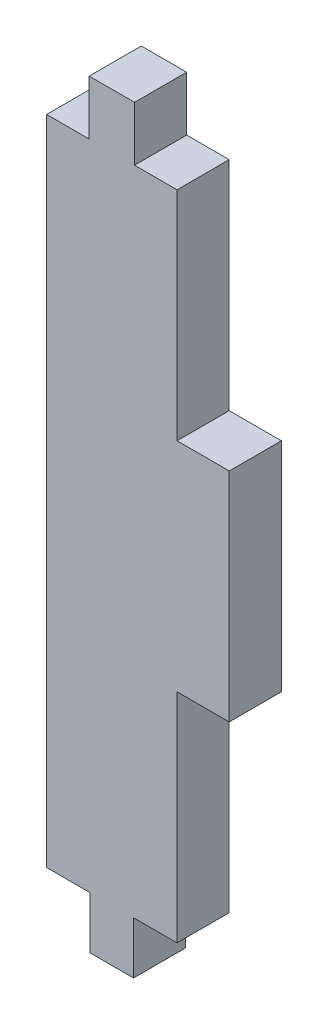
ISO-10303-21;
HEADER;
FILE_DESCRIPTION(('STEP AP214'),'2;1');
FILE_NAME('part.step','',(''),(''),'','','');
FILE_SCHEMA(('AUTOMOTIVE_DESIGN { 1 0 10303 214 1 1 1 1 }'));
ENDSEC;
DATA;
#1=APPLICATION_CONTEXT('core data for automotive mechanical design processes');
#2=APPLICATION_PROTOCOL_DEFINITION('international standard','automotive_design',2000,#1);
#3=PRODUCT_CONTEXT('',#1,'mechanical');
#4=PRODUCT('Part','Part','',(#3));
#5=PRODUCT_RELATED_PRODUCT_CATEGORY('part','',(#4));
#6=PRODUCT_DEFINITION_FORMATION('','',#4);
#7=PRODUCT_DEFINITION_CONTEXT('part definition',#1,'design');
#8=PRODUCT_DEFINITION('design','',#6,#7);
#9=PRODUCT_DEFINITION_SHAPE('','',#8);
#10=(LENGTH_UNIT() NAMED_UNIT(*) SI_UNIT(.MILLI.,.METRE.));
#11=(NAMED_UNIT(*) PLANE_ANGLE_UNIT() SI_UNIT($,.RADIAN.));
#12=(NAMED_UNIT(*) SI_UNIT($,.STERADIAN.) SOLID_ANGLE_UNIT());
#13=UNCERTAINTY_MEASURE_WITH_UNIT(LENGTH_MEASURE(1.E-05),#10,'distance_accuracy_value','');
#14=(GEOMETRIC_REPRESENTATION_CONTEXT(3) GLOBAL_UNCERTAINTY_ASSIGNED_CONTEXT((#13)) GLOBAL_UNIT_ASSIGNED_CONTEXT((#10,
#11,#12)) REPRESENTATION_CONTEXT('',''));
#15=CARTESIAN_POINT('',(0.,0.,0.));
#16=DIRECTION('',(0.,0.,1.));
#17=DIRECTION('',(1.,0.,0.));
#18=AXIS2_PLACEMENT_3D('',#15,#16,#17);
#19=CARTESIAN_POINT('',(-37.2306097479879,-66.1800034107966,0.));
#20=DIRECTION('',(0.,0.,1.));
#21=DIRECTION('',(1.,0.,0.));
#22=AXIS2_PLACEMENT_3D('',#19,#20,#21);
#23=PLANE('',#22);
#24=DIRECTION('',(1.,0.,0.));
#25=VECTOR('',#24,1.);
#26=CARTESIAN_POINT('',(-37.2306097479879,-66.1800034107966,0.));
#27=LINE('',#26,#25);
#28=CARTESIAN_POINT('',(-30.5639430813212,-66.1800034107966,0.));
#29=VERTEX_POINT('',#28);
#30=CARTESIAN_POINT('',(-27.2306097479879,-66.1800034107966,0.));
#31=VERTEX_POINT('',#30);
#32=EDGE_CURVE('E224',#29,#31,#27,.T.);
#33=ORIENTED_EDGE('',*,*,#32,.F.);
#34=DIRECTION('',(0.,-1.,0.));
#35=VECTOR('',#34,1.);
#36=CARTESIAN_POINT('',(-30.5639430813212,-62.1800034107967,0.));
#37=LINE('',#36,#35);
#38=CARTESIAN_POINT('',(-30.5639430813212,-70.1800034107967,0.));
#39=VERTEX_POINT('',#38);
#40=EDGE_CURVE('E306',#29,#39,#37,.T.);
#41=ORIENTED_EDGE('',*,*,#40,.T.);
#42=DIRECTION('',(1.,0.,0.));
#43=VECTOR('',#42,1.);
#44=CARTESIAN_POINT('',(-33.8972764146545,-70.1800034107967,0.));
#45=LINE('',#44,#43);
#46=CARTESIAN_POINT('',(-33.8972764146545,-70.1800034107967,0.));
#47=VERTEX_POINT('',#46);
#48=EDGE_CURVE('E308',#47,#39,#45,.T.);
#49=ORIENTED_EDGE('',*,*,#48,.F.);
#50=DIRECTION('',(0.,-1.,0.));
#51=VECTOR('',#50,1.);
#52=CARTESIAN_POINT('',(-33.8972764146545,-62.1800034107967,0.));
#53=LINE('',#52,#51);
#54=CARTESIAN_POINT('',(-33.8972764146545,-66.1800034107966,0.));
#55=VERTEX_POINT('',#54);
#56=EDGE_CURVE('E301',#55,#47,#53,.T.);
#57=ORIENTED_EDGE('',*,*,#56,.F.);
#58=CARTESIAN_POINT('',(-37.2306097479879,-66.1800034107966,0.));
#59=VERTEX_POINT('',#58);
#60=EDGE_CURVE('E219',#59,#55,#27,.T.);
#61=ORIENTED_EDGE('',*,*,#60,.F.);
#62=DIRECTION('',(0.,-1.,0.));
#63=VECTOR('',#62,1.);
#64=CARTESIAN_POINT('',(-37.2306097479879,-16.1800034107966,0.));
#65=LINE('',#64,#63);
#66=CARTESIAN_POINT('',(-37.2306097479879,-16.1800034107966,0.));
#67=VERTEX_POINT('',#66);
#68=EDGE_CURVE('E296',#67,#59,#65,.T.);
#69=ORIENTED_EDGE('',*,*,#68,.F.);
#70=DIRECTION('',(1.,0.,0.));
#71=VECTOR('',#70,1.);
#72=CARTESIAN_POINT('',(-37.2306097479879,-16.1800034107966,0.));
#73=LINE('',#72,#71);
#74=CARTESIAN_POINT('',(-33.9704459293163,-16.1800034107966,0.));
#75=VERTEX_POINT('',#74);
#76=EDGE_CURVE('E235',#67,#75,#73,.T.);
#77=ORIENTED_EDGE('',*,*,#76,.T.);
#78=DIRECTION('',(0.,-1.,0.));
#79=VECTOR('',#78,1.);
#80=CARTESIAN_POINT('',(-33.9704459293163,-12.0043965756084,0.));
#81=LINE('',#80,#79);
#82=CARTESIAN_POINT('',(-33.9704459293163,-12.0043965756084,0.));
#83=VERTEX_POINT('',#82);
#84=EDGE_CURVE('E280',#83,#75,#81,.T.);
#85=ORIENTED_EDGE('',*,*,#84,.F.);
#86=DIRECTION('',(1.,0.,0.));
#87=VECTOR('',#86,1.);
#88=CARTESIAN_POINT('',(-33.9704459293163,-12.0043965756084,0.));
#89=LINE('',#88,#87);
#90=CARTESIAN_POINT('',(-30.4907735666594,-12.0043965756084,0.));
#91=VERTEX_POINT('',#90);
#92=EDGE_CURVE('E286',#83,#91,#89,.T.);
#93=ORIENTED_EDGE('',*,*,#92,.T.);
#94=DIRECTION('',(0.,-1.,0.));
#95=VECTOR('',#94,1.);
#96=CARTESIAN_POINT('',(-30.4907735666594,-12.0043965756084,0.));
#97=LINE('',#96,#95);
#98=CARTESIAN_POINT('',(-30.4907735666594,-16.1800034107966,0.));
#99=VERTEX_POINT('',#98);
#100=EDGE_CURVE('E289',#91,#99,#97,.T.);
#101=ORIENTED_EDGE('',*,*,#100,.T.);
#102=CARTESIAN_POINT('',(-27.2306097479879,-16.1800034107966,0.));
#103=VERTEX_POINT('',#102);
#104=EDGE_CURVE('E221',#99,#103,#73,.T.);
#105=ORIENTED_EDGE('',*,*,#104,.T.);
#106=DIRECTION('',(0.,-1.,0.));
#107=VECTOR('',#106,1.);
#108=CARTESIAN_POINT('',(-27.2306097479879,-16.1800034107966,0.));
#109=LINE('',#108,#107);
#110=CARTESIAN_POINT('',(-27.2306097479879,-32.8466700774633,0.));
#111=VERTEX_POINT('',#110);
#112=EDGE_CURVE('E190',#103,#111,#109,.T.);
#113=ORIENTED_EDGE('',*,*,#112,.T.);
#114=DIRECTION('',(1.,0.,0.));
#115=VECTOR('',#114,1.);
#116=CARTESIAN_POINT('',(-27.2306097479879,-32.8466700774633,0.));
#117=LINE('',#116,#115);
#118=CARTESIAN_POINT('',(-23.2306097479879,-32.8466700774633,0.));
#119=VERTEX_POINT('',#118);
#120=EDGE_CURVE('E175',#111,#119,#117,.T.);
#121=ORIENTED_EDGE('',*,*,#120,.T.);
#122=DIRECTION('',(0.,1.,0.));
#123=VECTOR('',#122,1.);
#124=CARTESIAN_POINT('',(-23.2306097479879,-49.51333674413,0.));
#125=LINE('',#124,#123);
#126=CARTESIAN_POINT('',(-23.2306097479879,-49.51333674413,0.));
#127=VERTEX_POINT('',#126);
#128=EDGE_CURVE('E164',#127,#119,#125,.T.);
#129=ORIENTED_EDGE('',*,*,#128,.F.);
#130=DIRECTION('',(1.,0.,0.));
#131=VECTOR('',#130,1.);
#132=CARTESIAN_POINT('',(-27.2306097479879,-49.51333674413,0.));
#133=LINE('',#132,#131);
#134=CARTESIAN_POINT('',(-27.2306097479879,-49.51333674413,0.));
#135=VERTEX_POINT('',#134);
#136=EDGE_CURVE('E185',#135,#127,#133,.T.);
#137=ORIENTED_EDGE('',*,*,#136,.F.);
#138=EDGE_CURVE('E210',#135,#31,#109,.T.);
#139=ORIENTED_EDGE('',*,*,#138,.T.);
#140=EDGE_LOOP('',(#33,#41,#49,#57,#61,#69,#77,#85,#93,#101,#105,#113,#121,#129,#137,#139));
#141=FACE_BOUND('',#140,.T.);
#142=ADVANCED_FACE('F102',(#141),#23,.F.);
#143=CARTESIAN_POINT('',(-37.2306097479879,-66.1800034107966,4.));
#144=DIRECTION('',(0.,0.,1.));
#145=DIRECTION('',(1.,0.,0.));
#146=AXIS2_PLACEMENT_3D('',#143,#144,#145);
#147=PLANE('',#146);
#148=DIRECTION('',(1.,0.,0.));
#149=VECTOR('',#148,1.);
#150=CARTESIAN_POINT('',(-37.2306097479879,-66.1800034107966,4.));
#151=LINE('',#150,#149);
#152=CARTESIAN_POINT('',(-37.2306097479879,-66.1800034107966,4.));
#153=VERTEX_POINT('',#152);
#154=CARTESIAN_POINT('',(-33.8972764146545,-66.1800034107966,4.));
#155=VERTEX_POINT('',#154);
#156=EDGE_CURVE('E339',#153,#155,#151,.T.);
#157=ORIENTED_EDGE('',*,*,#156,.T.);
#158=DIRECTION('',(0.,-1.,0.));
#159=VECTOR('',#158,1.);
#160=CARTESIAN_POINT('',(-33.8972764146545,-62.1800034107967,4.));
#161=LINE('',#160,#159);
#162=CARTESIAN_POINT('',(-33.8972764146545,-70.1800034107967,4.));
#163=VERTEX_POINT('',#162);
#164=EDGE_CURVE('E304',#155,#163,#161,.T.);
#165=ORIENTED_EDGE('',*,*,#164,.T.);
#166=DIRECTION('',(1.,0.,0.));
#167=VECTOR('',#166,1.);
#168=CARTESIAN_POINT('',(-33.8972764146545,-70.1800034107967,4.));
#169=LINE('',#168,#167);
#170=CARTESIAN_POINT('',(-30.5639430813212,-70.1800034107967,4.));
#171=VERTEX_POINT('',#170);
#172=EDGE_CURVE('E300',#163,#171,#169,.T.);
#173=ORIENTED_EDGE('',*,*,#172,.T.);
#174=DIRECTION('',(0.,-1.,0.));
#175=VECTOR('',#174,1.);
#176=CARTESIAN_POINT('',(-30.5639430813212,-62.1800034107967,4.));
#177=LINE('',#176,#175);
#178=CARTESIAN_POINT('',(-30.5639430813212,-66.1800034107966,4.));
#179=VERTEX_POINT('',#178);
#180=EDGE_CURVE('E298',#179,#171,#177,.T.);
#181=ORIENTED_EDGE('',*,*,#180,.F.);
#182=CARTESIAN_POINT('',(-27.2306097479879,-66.1800034107966,4.));
#183=VERTEX_POINT('',#182);
#184=EDGE_CURVE('E348',#179,#183,#151,.T.);
#185=ORIENTED_EDGE('',*,*,#184,.T.);
#186=DIRECTION('',(0.,-1.,0.));
#187=VECTOR('',#186,1.);
#188=CARTESIAN_POINT('',(-27.2306097479879,-16.1800034107966,4.));
#189=LINE('',#188,#187);
#190=CARTESIAN_POINT('',(-27.2306097479879,-49.51333674413,4.));
#191=VERTEX_POINT('',#190);
#192=EDGE_CURVE('E342',#191,#183,#189,.T.);
#193=ORIENTED_EDGE('',*,*,#192,.F.);
#194=DIRECTION('',(1.,0.,0.));
#195=VECTOR('',#194,1.);
#196=CARTESIAN_POINT('',(-27.2306097479879,-49.51333674413,4.));
#197=LINE('',#196,#195);
#198=CARTESIAN_POINT('',(-23.2306097479879,-49.51333674413,4.));
#199=VERTEX_POINT('',#198);
#200=EDGE_CURVE('E191',#191,#199,#197,.T.);
#201=ORIENTED_EDGE('',*,*,#200,.T.);
#202=DIRECTION('',(0.,1.,0.));
#203=VECTOR('',#202,1.);
#204=CARTESIAN_POINT('',(-23.2306097479879,-49.51333674413,4.));
#205=LINE('',#204,#203);
#206=CARTESIAN_POINT('',(-23.2306097479879,-32.8466700774633,4.));
#207=VERTEX_POINT('',#206);
#208=EDGE_CURVE('E194',#199,#207,#205,.T.);
#209=ORIENTED_EDGE('',*,*,#208,.T.);
#210=DIRECTION('',(1.,0.,0.));
#211=VECTOR('',#210,1.);
#212=CARTESIAN_POINT('',(-27.2306097479879,-32.8466700774633,4.));
#213=LINE('',#212,#211);
#214=CARTESIAN_POINT('',(-27.2306097479879,-32.8466700774633,4.));
#215=VERTEX_POINT('',#214);
#216=EDGE_CURVE('E178',#215,#207,#213,.T.);
#217=ORIENTED_EDGE('',*,*,#216,.F.);
#218=CARTESIAN_POINT('',(-27.2306097479879,-16.1800034107966,4.));
#219=VERTEX_POINT('',#218);
#220=EDGE_CURVE('E229',#219,#215,#189,.T.);
#221=ORIENTED_EDGE('',*,*,#220,.F.);
#222=DIRECTION('',(1.,0.,0.));
#223=VECTOR('',#222,1.);
#224=CARTESIAN_POINT('',(-37.2306097479879,-16.1800034107966,4.));
#225=LINE('',#224,#223);
#226=CARTESIAN_POINT('',(-30.4907735666594,-16.1800034107966,4.));
#227=VERTEX_POINT('',#226);
#228=EDGE_CURVE('E336',#227,#219,#225,.T.);
#229=ORIENTED_EDGE('',*,*,#228,.F.);
#230=DIRECTION('',(0.,-1.,0.));
#231=VECTOR('',#230,1.);
#232=CARTESIAN_POINT('',(-30.4907735666594,-12.0043965756084,4.));
#233=LINE('',#232,#231);
#234=CARTESIAN_POINT('',(-30.4907735666594,-12.0043965756084,4.));
#235=VERTEX_POINT('',#234);
#236=EDGE_CURVE('E279',#235,#227,#233,.T.);
#237=ORIENTED_EDGE('',*,*,#236,.F.);
#238=DIRECTION('',(1.,0.,0.));
#239=VECTOR('',#238,1.);
#240=CARTESIAN_POINT('',(-33.9704459293163,-12.0043965756084,4.));
#241=LINE('',#240,#239);
#242=CARTESIAN_POINT('',(-33.9704459293163,-12.0043965756084,4.));
#243=VERTEX_POINT('',#242);
#244=EDGE_CURVE('E276',#243,#235,#241,.T.);
#245=ORIENTED_EDGE('',*,*,#244,.F.);
#246=DIRECTION('',(0.,-1.,0.));
#247=VECTOR('',#246,1.);
#248=CARTESIAN_POINT('',(-33.9704459293163,-12.0043965756084,4.));
#249=LINE('',#248,#247);
#250=CARTESIAN_POINT('',(-33.9704459293163,-16.1800034107966,4.));
#251=VERTEX_POINT('',#250);
#252=EDGE_CURVE('E282',#243,#251,#249,.T.);
#253=ORIENTED_EDGE('',*,*,#252,.T.);
#254=CARTESIAN_POINT('',(-37.2306097479879,-16.1800034107966,4.));
#255=VERTEX_POINT('',#254);
#256=EDGE_CURVE('E244',#255,#251,#225,.T.);
#257=ORIENTED_EDGE('',*,*,#256,.F.);
#258=DIRECTION('',(0.,-1.,0.));
#259=VECTOR('',#258,1.);
#260=CARTESIAN_POINT('',(-37.2306097479879,-16.1800034107966,4.));
#261=LINE('',#260,#259);
#262=EDGE_CURVE('E239',#255,#153,#261,.T.);
#263=ORIENTED_EDGE('',*,*,#262,.T.);
#264=EDGE_LOOP('',(#157,#165,#173,#181,#185,#193,#201,#209,#217,#221,#229,#237,#245,#253,#257,#263));
#265=FACE_BOUND('',#264,.T.);
#266=ADVANCED_FACE('F354',(#265),#147,.T.);
#267=CARTESIAN_POINT('',(-37.2306097479879,-16.1800034107966,4.));
#268=DIRECTION('',(0.,1.,0.));
#269=DIRECTION('',(0.,0.,1.));
#270=AXIS2_PLACEMENT_3D('',#267,#268,#269);
#271=PLANE('',#270);
#272=ORIENTED_EDGE('',*,*,#256,.T.);
#273=DIRECTION('',(0.,0.,-1.));
#274=VECTOR('',#273,1.);
#275=CARTESIAN_POINT('',(-33.9704459293163,-16.1800034107966,4.));
#276=LINE('',#275,#274);
#277=EDGE_CURVE('E253',#251,#75,#276,.T.);
#278=ORIENTED_EDGE('',*,*,#277,.T.);
#279=ORIENTED_EDGE('',*,*,#76,.F.);
#280=DIRECTION('',(0.,0.,-1.));
#281=VECTOR('',#280,1.);
#282=CARTESIAN_POINT('',(-37.2306097479879,-16.1800034107966,4.));
#283=LINE('',#282,#281);
#284=EDGE_CURVE('E240',#255,#67,#283,.T.);
#285=ORIENTED_EDGE('',*,*,#284,.F.);
#286=EDGE_LOOP('',(#272,#278,#279,#285));
#287=FACE_BOUND('',#286,.T.);
#288=ADVANCED_FACE('F361',(#287),#271,.T.);
#289=CARTESIAN_POINT('',(-37.2306097479879,-16.1800034107966,4.));
#290=DIRECTION('',(1.,0.,0.));
#291=DIRECTION('',(0.,1.,0.));
#292=AXIS2_PLACEMENT_3D('',#289,#290,#291);
#293=PLANE('',#292);
#294=ORIENTED_EDGE('',*,*,#68,.T.);
#295=DIRECTION('',(0.,0.,-1.));
#296=VECTOR('',#295,1.);
#297=CARTESIAN_POINT('',(-37.2306097479879,-66.1800034107966,4.));
#298=LINE('',#297,#296);
#299=EDGE_CURVE('E247',#153,#59,#298,.T.);
#300=ORIENTED_EDGE('',*,*,#299,.F.);
#301=ORIENTED_EDGE('',*,*,#262,.F.);
#302=ORIENTED_EDGE('',*,*,#284,.T.);
#303=EDGE_LOOP('',(#294,#300,#301,#302));
#304=FACE_BOUND('',#303,.T.);
#305=ADVANCED_FACE('F358',(#304),#293,.F.);
#306=CARTESIAN_POINT('',(-37.2306097479879,-66.1800034107966,4.));
#307=DIRECTION('',(0.,1.,0.));
#308=DIRECTION('',(0.,0.,1.));
#309=AXIS2_PLACEMENT_3D('',#306,#307,#308);
#310=PLANE('',#309);
#311=DIRECTION('',(0.,0.,-1.));
#312=VECTOR('',#311,1.);
#313=CARTESIAN_POINT('',(-33.8972764146545,-66.1800034107966,4.));
#314=LINE('',#313,#312);
#315=EDGE_CURVE('E263',#155,#55,#314,.T.);
#316=ORIENTED_EDGE('',*,*,#315,.F.);
#317=ORIENTED_EDGE('',*,*,#156,.F.);
#318=ORIENTED_EDGE('',*,*,#299,.T.);
#319=ORIENTED_EDGE('',*,*,#60,.T.);
#320=EDGE_LOOP('',(#316,#317,#318,#319));
#321=FACE_BOUND('',#320,.T.);
#322=ADVANCED_FACE('F360',(#321),#310,.F.);
#323=ORIENTED_EDGE('',*,*,#184,.F.);
#324=DIRECTION('',(0.,0.,-1.));
#325=VECTOR('',#324,1.);
#326=CARTESIAN_POINT('',(-30.5639430813212,-66.1800034107966,4.));
#327=LINE('',#326,#325);
#328=EDGE_CURVE('E260',#179,#29,#327,.T.);
#329=ORIENTED_EDGE('',*,*,#328,.T.);
#330=ORIENTED_EDGE('',*,*,#32,.T.);
#331=DIRECTION('',(0.,0.,-1.));
#332=VECTOR('',#331,1.);
#333=CARTESIAN_POINT('',(-27.2306097479879,-66.1800034107966,4.));
#334=LINE('',#333,#332);
#335=EDGE_CURVE('E218',#183,#31,#334,.T.);
#336=ORIENTED_EDGE('',*,*,#335,.F.);
#337=EDGE_LOOP('',(#323,#329,#330,#336));
#338=FACE_BOUND('',#337,.T.);
#339=ADVANCED_FACE('F367',(#338),#310,.F.);
#340=CARTESIAN_POINT('',(-27.2306097479879,-16.1800034107966,4.));
#341=DIRECTION('',(1.,0.,0.));
#342=DIRECTION('',(0.,1.,0.));
#343=AXIS2_PLACEMENT_3D('',#340,#341,#342);
#344=PLANE('',#343);
#345=DIRECTION('',(0.,0.,-1.));
#346=VECTOR('',#345,1.);
#347=CARTESIAN_POINT('',(-27.2306097479879,-49.51333674413,4.));
#348=LINE('',#347,#346);
#349=EDGE_CURVE('E12',#191,#135,#348,.T.);
#350=ORIENTED_EDGE('',*,*,#349,.F.);
#351=ORIENTED_EDGE('',*,*,#192,.T.);
#352=ORIENTED_EDGE('',*,*,#335,.T.);
#353=ORIENTED_EDGE('',*,*,#138,.F.);
#354=EDGE_LOOP('',(#350,#351,#352,#353));
#355=FACE_BOUND('',#354,.T.);
#356=ADVANCED_FACE('F215',(#355),#344,.T.);
#357=ORIENTED_EDGE('',*,*,#220,.T.);
#358=DIRECTION('',(0.,0.,-1.));
#359=VECTOR('',#358,1.);
#360=CARTESIAN_POINT('',(-27.2306097479879,-32.8466700774633,4.));
#361=LINE('',#360,#359);
#362=EDGE_CURVE('E112',#215,#111,#361,.T.);
#363=ORIENTED_EDGE('',*,*,#362,.T.);
#364=ORIENTED_EDGE('',*,*,#112,.F.);
#365=DIRECTION('',(0.,0.,-1.));
#366=VECTOR('',#365,1.);
#367=CARTESIAN_POINT('',(-27.2306097479879,-16.1800034107966,4.));
#368=LINE('',#367,#366);
#369=EDGE_CURVE('E243',#219,#103,#368,.T.);
#370=ORIENTED_EDGE('',*,*,#369,.F.);
#371=EDGE_LOOP('',(#357,#363,#364,#370));
#372=FACE_BOUND('',#371,.T.);
#373=ADVANCED_FACE('F407',(#372),#344,.T.);
#374=DIRECTION('',(0.,0.,-1.));
#375=VECTOR('',#374,1.);
#376=CARTESIAN_POINT('',(-30.4907735666594,-16.1800034107966,4.));
#377=LINE('',#376,#375);
#378=EDGE_CURVE('E121',#227,#99,#377,.T.);
#379=ORIENTED_EDGE('',*,*,#378,.F.);
#380=ORIENTED_EDGE('',*,*,#228,.T.);
#381=ORIENTED_EDGE('',*,*,#369,.T.);
#382=ORIENTED_EDGE('',*,*,#104,.F.);
#383=EDGE_LOOP('',(#379,#380,#381,#382));
#384=FACE_BOUND('',#383,.T.);
#385=ADVANCED_FACE('F371',(#384),#271,.T.);
#386=CARTESIAN_POINT('',(-33.8972764146545,-70.1800034107967,4.));
#387=DIRECTION('',(0.,1.,0.));
#388=DIRECTION('',(0.,0.,1.));
#389=AXIS2_PLACEMENT_3D('',#386,#387,#388);
#390=PLANE('',#389);
#391=ORIENTED_EDGE('',*,*,#48,.T.);
#392=DIRECTION('',(0.,0.,-1.));
#393=VECTOR('',#392,1.);
#394=CARTESIAN_POINT('',(-30.5639430813212,-70.1800034107967,4.));
#395=LINE('',#394,#393);
#396=EDGE_CURVE('E268',#171,#39,#395,.T.);
#397=ORIENTED_EDGE('',*,*,#396,.F.);
#398=ORIENTED_EDGE('',*,*,#172,.F.);
#399=DIRECTION('',(0.,0.,-1.));
#400=VECTOR('',#399,1.);
#401=CARTESIAN_POINT('',(-33.8972764146545,-70.1800034107967,4.));
#402=LINE('',#401,#400);
#403=EDGE_CURVE('E290',#163,#47,#402,.T.);
#404=ORIENTED_EDGE('',*,*,#403,.T.);
#405=EDGE_LOOP('',(#391,#397,#398,#404));
#406=FACE_BOUND('',#405,.T.);
#407=ADVANCED_FACE('F324',(#406),#390,.F.);
#408=CARTESIAN_POINT('',(-30.5639430813212,-62.1800034107967,4.));
#409=DIRECTION('',(1.,0.,0.));
#410=DIRECTION('',(0.,0.,-1.));
#411=AXIS2_PLACEMENT_3D('',#408,#409,#410);
#412=PLANE('',#411);
#413=ORIENTED_EDGE('',*,*,#328,.F.);
#414=ORIENTED_EDGE('',*,*,#180,.T.);
#415=ORIENTED_EDGE('',*,*,#396,.T.);
#416=ORIENTED_EDGE('',*,*,#40,.F.);
#417=EDGE_LOOP('',(#413,#414,#415,#416));
#418=FACE_BOUND('',#417,.T.);
#419=ADVANCED_FACE('F321',(#418),#412,.T.);
#420=CARTESIAN_POINT('',(-33.8972764146545,-62.1800034107967,4.));
#421=DIRECTION('',(1.,0.,0.));
#422=DIRECTION('',(0.,0.,-1.));
#423=AXIS2_PLACEMENT_3D('',#420,#421,#422);
#424=PLANE('',#423);
#425=ORIENTED_EDGE('',*,*,#164,.F.);
#426=ORIENTED_EDGE('',*,*,#315,.T.);
#427=ORIENTED_EDGE('',*,*,#56,.T.);
#428=ORIENTED_EDGE('',*,*,#403,.F.);
#429=EDGE_LOOP('',(#425,#426,#427,#428));
#430=FACE_BOUND('',#429,.T.);
#431=ADVANCED_FACE('F385',(#430),#424,.F.);
#432=CARTESIAN_POINT('',(-23.2306097479879,-49.51333674413,4.));
#433=DIRECTION('',(-1.,0.,0.));
#434=DIRECTION('',(0.,0.,1.));
#435=AXIS2_PLACEMENT_3D('',#432,#433,#434);
#436=PLANE('',#435);
#437=ORIENTED_EDGE('',*,*,#128,.T.);
#438=DIRECTION('',(0.,0.,-1.));
#439=VECTOR('',#438,1.);
#440=CARTESIAN_POINT('',(-23.2306097479879,-32.8466700774633,4.));
#441=LINE('',#440,#439);
#442=EDGE_CURVE('E171',#207,#119,#441,.T.);
#443=ORIENTED_EDGE('',*,*,#442,.F.);
#444=ORIENTED_EDGE('',*,*,#208,.F.);
#445=DIRECTION('',(0.,0.,-1.));
#446=VECTOR('',#445,1.);
#447=CARTESIAN_POINT('',(-23.2306097479879,-49.51333674413,4.));
#448=LINE('',#447,#446);
#449=EDGE_CURVE('E180',#199,#127,#448,.T.);
#450=ORIENTED_EDGE('',*,*,#449,.T.);
#451=EDGE_LOOP('',(#437,#443,#444,#450));
#452=FACE_BOUND('',#451,.T.);
#453=ADVANCED_FACE('F182',(#452),#436,.F.);
#454=CARTESIAN_POINT('',(-27.2306097479879,-32.8466700774633,4.));
#455=DIRECTION('',(0.,1.,0.));
#456=DIRECTION('',(0.,0.,1.));
#457=AXIS2_PLACEMENT_3D('',#454,#455,#456);
#458=PLANE('',#457);
#459=ORIENTED_EDGE('',*,*,#120,.F.);
#460=ORIENTED_EDGE('',*,*,#362,.F.);
#461=ORIENTED_EDGE('',*,*,#216,.T.);
#462=ORIENTED_EDGE('',*,*,#442,.T.);
#463=EDGE_LOOP('',(#459,#460,#461,#462));
#464=FACE_BOUND('',#463,.T.);
#465=ADVANCED_FACE('F172',(#464),#458,.T.);
#466=CARTESIAN_POINT('',(-27.2306097479879,-49.51333674413,4.));
#467=DIRECTION('',(0.,1.,0.));
#468=DIRECTION('',(0.,0.,1.));
#469=AXIS2_PLACEMENT_3D('',#466,#467,#468);
#470=PLANE('',#469);
#471=ORIENTED_EDGE('',*,*,#136,.T.);
#472=ORIENTED_EDGE('',*,*,#449,.F.);
#473=ORIENTED_EDGE('',*,*,#200,.F.);
#474=ORIENTED_EDGE('',*,*,#349,.T.);
#475=EDGE_LOOP('',(#471,#472,#473,#474));
#476=FACE_BOUND('',#475,.T.);
#477=ADVANCED_FACE('F104',(#476),#470,.F.);
#478=CARTESIAN_POINT('',(-30.4907735666594,-12.0043965756084,4.));
#479=DIRECTION('',(1.,0.,0.));
#480=DIRECTION('',(0.,0.,-1.));
#481=AXIS2_PLACEMENT_3D('',#478,#479,#480);
#482=PLANE('',#481);
#483=ORIENTED_EDGE('',*,*,#236,.T.);
#484=ORIENTED_EDGE('',*,*,#378,.T.);
#485=ORIENTED_EDGE('',*,*,#100,.F.);
#486=DIRECTION('',(0.,0.,-1.));
#487=VECTOR('',#486,1.);
#488=CARTESIAN_POINT('',(-30.4907735666594,-12.0043965756084,4.));
#489=LINE('',#488,#487);
#490=EDGE_CURVE('E285',#235,#91,#489,.T.);
#491=ORIENTED_EDGE('',*,*,#490,.F.);
#492=EDGE_LOOP('',(#483,#484,#485,#491));
#493=FACE_BOUND('',#492,.T.);
#494=ADVANCED_FACE('F379',(#493),#482,.T.);
#495=CARTESIAN_POINT('',(-33.9704459293163,-12.0043965756084,4.));
#496=DIRECTION('',(0.,1.,0.));
#497=DIRECTION('',(0.,0.,1.));
#498=AXIS2_PLACEMENT_3D('',#495,#496,#497);
#499=PLANE('',#498);
#500=ORIENTED_EDGE('',*,*,#92,.F.);
#501=DIRECTION('',(0.,0.,-1.));
#502=VECTOR('',#501,1.);
#503=CARTESIAN_POINT('',(-33.9704459293163,-12.0043965756084,4.));
#504=LINE('',#503,#502);
#505=EDGE_CURVE('E294',#243,#83,#504,.T.);
#506=ORIENTED_EDGE('',*,*,#505,.F.);
#507=ORIENTED_EDGE('',*,*,#244,.T.);
#508=ORIENTED_EDGE('',*,*,#490,.T.);
#509=EDGE_LOOP('',(#500,#506,#507,#508));
#510=FACE_BOUND('',#509,.T.);
#511=ADVANCED_FACE('F377',(#510),#499,.T.);
#512=CARTESIAN_POINT('',(-33.9704459293163,-12.0043965756084,4.));
#513=DIRECTION('',(1.,0.,0.));
#514=DIRECTION('',(0.,0.,-1.));
#515=AXIS2_PLACEMENT_3D('',#512,#513,#514);
#516=PLANE('',#515);
#517=ORIENTED_EDGE('',*,*,#277,.F.);
#518=ORIENTED_EDGE('',*,*,#252,.F.);
#519=ORIENTED_EDGE('',*,*,#505,.T.);
#520=ORIENTED_EDGE('',*,*,#84,.T.);
#521=EDGE_LOOP('',(#517,#518,#519,#520));
#522=FACE_BOUND('',#521,.T.);
#523=ADVANCED_FACE('F374',(#522),#516,.F.);
#524=CLOSED_SHELL('',(#142,#266,#288,#305,#322,#339,#356,#373,#385,#407,#419,#431,#453,#465,
#477,#494,#511,#523));
#525=MANIFOLD_SOLID_BREP('B2',#524);
#526=ADVANCED_BREP_SHAPE_REPRESENTATION('',(#18,#525),#14);
#527=SHAPE_DEFINITION_REPRESENTATION(#9,#526);
ENDSEC;
END-ISO-10303-21;
